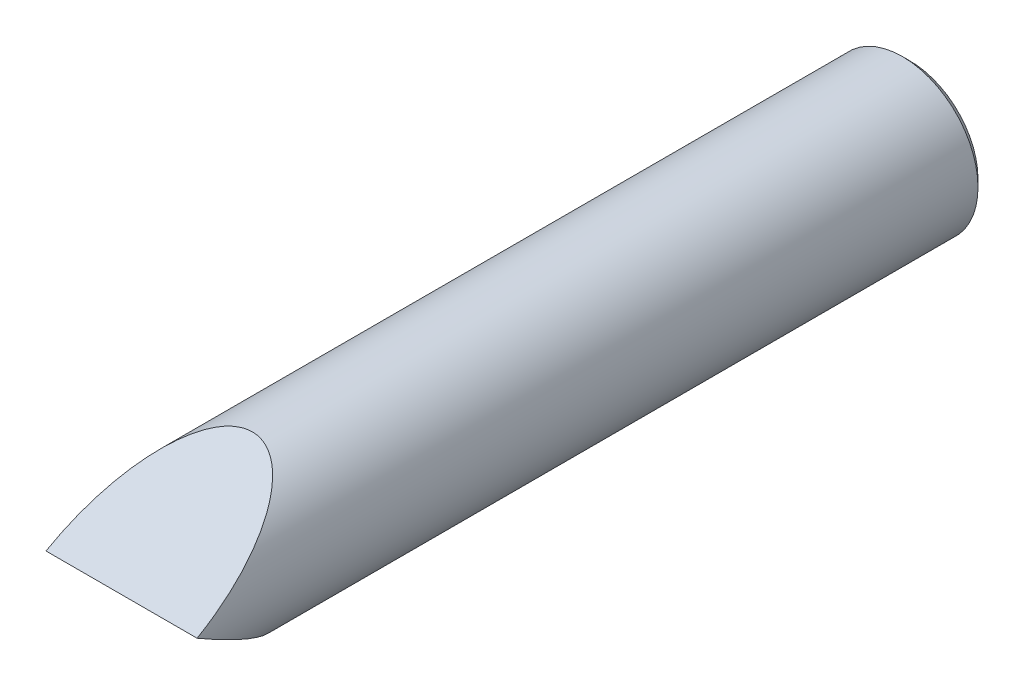
ISO-10303-21;
HEADER;
FILE_DESCRIPTION(('STEP AP214'),'2;1');
FILE_NAME('part.step','',(''),(''),'','','');
FILE_SCHEMA(('AUTOMOTIVE_DESIGN { 1 0 10303 214 1 1 1 1 }'));
ENDSEC;
DATA;
#1=APPLICATION_CONTEXT('core data for automotive mechanical design processes');
#2=APPLICATION_PROTOCOL_DEFINITION('international standard','automotive_design',2000,#1);
#3=PRODUCT_CONTEXT('',#1,'mechanical');
#4=PRODUCT('Part','Part','',(#3));
#5=PRODUCT_RELATED_PRODUCT_CATEGORY('part','',(#4));
#6=PRODUCT_DEFINITION_FORMATION('','',#4);
#7=PRODUCT_DEFINITION_CONTEXT('part definition',#1,'design');
#8=PRODUCT_DEFINITION('design','',#6,#7);
#9=PRODUCT_DEFINITION_SHAPE('','',#8);
#10=(LENGTH_UNIT() NAMED_UNIT(*) SI_UNIT(.MILLI.,.METRE.));
#11=(NAMED_UNIT(*) PLANE_ANGLE_UNIT() SI_UNIT($,.RADIAN.));
#12=(NAMED_UNIT(*) SI_UNIT($,.STERADIAN.) SOLID_ANGLE_UNIT());
#13=UNCERTAINTY_MEASURE_WITH_UNIT(LENGTH_MEASURE(1.E-05),#10,'distance_accuracy_value','');
#14=(GEOMETRIC_REPRESENTATION_CONTEXT(3) GLOBAL_UNCERTAINTY_ASSIGNED_CONTEXT((#13)) GLOBAL_UNIT_ASSIGNED_CONTEXT((#10,
#11,#12)) REPRESENTATION_CONTEXT('',''));
#15=CARTESIAN_POINT('',(0.,0.,0.));
#16=DIRECTION('',(0.,0.,1.));
#17=DIRECTION('',(1.,0.,0.));
#18=AXIS2_PLACEMENT_3D('',#15,#16,#17);
#19=CARTESIAN_POINT('',(0.,0.,-33.));
#20=DIRECTION('',(0.,0.,1.));
#21=DIRECTION('',(1.,0.,0.));
#22=AXIS2_PLACEMENT_3D('',#19,#20,#21);
#23=PLANE('',#22);
#24=CARTESIAN_POINT('',(0.,0.,-33.0000000000155));
#25=DIRECTION('',(0.,0.,1.));
#26=DIRECTION('',(1.,0.,0.));
#27=AXIS2_PLACEMENT_3D('',#24,#25,#26);
#28=CIRCLE('',#27,2.25000000000364);
#29=CARTESIAN_POINT('',(2.25000000000364,0.,-33.0000000000155));
#30=VERTEX_POINT('',#29);
#31=EDGE_CURVE('E19',#30,#30,#28,.T.);
#32=ORIENTED_EDGE('',*,*,#31,.F.);
#33=EDGE_LOOP('',(#32));
#34=FACE_BOUND('',#33,.T.);
#35=ADVANCED_FACE('F16',(#34),#23,.F.);
#36=CARTESIAN_POINT('',(-2.5,-3.,-12.1));
#37=DIRECTION('',(0.,0.866025403784439,-0.5));
#38=DIRECTION('',(0.,0.5,0.866025403784439));
#39=AXIS2_PLACEMENT_3D('',#36,#37,#38);
#40=PLANE('',#39);
#41=CARTESIAN_POINT('',(0.,0.,-6.90384757729336));
#42=DIRECTION('',(0.,0.866025403784439,-0.5));
#43=DIRECTION('',(0.,-0.5,-0.866025403784439));
#44=AXIS2_PLACEMENT_3D('',#41,#42,#43);
#45=ELLIPSE('',#44,5.,2.5);
#46=CARTESIAN_POINT('',(2.5,0.,-6.90384757729337));
#47=VERTEX_POINT('',#46);
#48=CARTESIAN_POINT('',(-2.5,0.,-6.90384757729337));
#49=VERTEX_POINT('',#48);
#50=EDGE_CURVE('E33',#47,#49,#45,.T.);
#51=ORIENTED_EDGE('',*,*,#50,.F.);
#52=DIRECTION('',(1.,0.,0.));
#53=VECTOR('',#52,1.);
#54=CARTESIAN_POINT('',(2.5,0.,-6.90384757729337));
#55=LINE('',#54,#53);
#56=EDGE_CURVE('E31',#47,#49,#55,.F.);
#57=ORIENTED_EDGE('',*,*,#56,.T.);
#58=EDGE_LOOP('',(#51,#57));
#59=FACE_BOUND('',#58,.T.);
#60=ADVANCED_FACE('F34',(#59),#40,.F.);
#61=CARTESIAN_POINT('',(0.,0.,-32.7500000000214));
#62=DIRECTION('',(0.,0.,1.));
#63=DIRECTION('',(1.,0.,0.));
#64=AXIS2_PLACEMENT_3D('',#61,#62,#63);
#65=CONICAL_SURFACE('',#64,2.49999999999773,0.785398163397448);
#66=ORIENTED_EDGE('',*,*,#31,.T.);
#67=EDGE_LOOP('',(#66));
#68=FACE_BOUND('',#67,.T.);
#69=CARTESIAN_POINT('',(0.,0.,-32.75));
#70=DIRECTION('',(0.,0.,-1.));
#71=DIRECTION('',(-1.,0.,0.));
#72=AXIS2_PLACEMENT_3D('',#69,#70,#71);
#73=CIRCLE('',#72,2.5);
#74=CARTESIAN_POINT('',(-2.5,0.,-32.75));
#75=VERTEX_POINT('',#74);
#76=EDGE_CURVE('E24',#75,#75,#73,.F.);
#77=ORIENTED_EDGE('',*,*,#76,.F.);
#78=EDGE_LOOP('',(#77));
#79=FACE_BOUND('',#78,.T.);
#80=ADVANCED_FACE('F48',(#68,#79),#65,.T.);
#81=CARTESIAN_POINT('',(2.5,3.,-12.1));
#82=DIRECTION('',(0.,-0.866025403784439,-0.5));
#83=DIRECTION('',(0.,0.5,-0.866025403784439));
#84=AXIS2_PLACEMENT_3D('',#81,#82,#83);
#85=PLANE('',#84);
#86=CARTESIAN_POINT('',(0.,0.,-6.90384757729336));
#87=DIRECTION('',(0.,-0.866025403784439,-0.5));
#88=DIRECTION('',(0.,0.5,-0.866025403784439));
#89=AXIS2_PLACEMENT_3D('',#86,#87,#88);
#90=ELLIPSE('',#89,5.,2.5);
#91=EDGE_CURVE('E11',#49,#47,#90,.T.);
#92=ORIENTED_EDGE('',*,*,#91,.F.);
#93=ORIENTED_EDGE('',*,*,#56,.F.);
#94=EDGE_LOOP('',(#92,#93));
#95=FACE_BOUND('',#94,.T.);
#96=ADVANCED_FACE('F38',(#95),#85,.F.);
#97=CARTESIAN_POINT('',(0.,0.,-19.3025));
#98=DIRECTION('',(0.,0.,-1.));
#99=DIRECTION('',(-1.,0.,0.));
#100=AXIS2_PLACEMENT_3D('',#97,#98,#99);
#101=CYLINDRICAL_SURFACE('',#100,2.5);
#102=ORIENTED_EDGE('',*,*,#76,.T.);
#103=EDGE_LOOP('',(#102));
#104=FACE_BOUND('',#103,.T.);
#105=ORIENTED_EDGE('',*,*,#91,.T.);
#106=ORIENTED_EDGE('',*,*,#50,.T.);
#107=EDGE_LOOP('',(#105,#106));
#108=FACE_BOUND('',#107,.T.);
#109=ADVANCED_FACE('F40',(#104,#108),#101,.T.);
#110=CLOSED_SHELL('',(#35,#60,#80,#96,#109));
#111=MANIFOLD_SOLID_BREP('B1',#110);
#112=ADVANCED_BREP_SHAPE_REPRESENTATION('',(#18,#111),#14);
#113=SHAPE_DEFINITION_REPRESENTATION(#9,#112);
ENDSEC;
END-ISO-10303-21;
